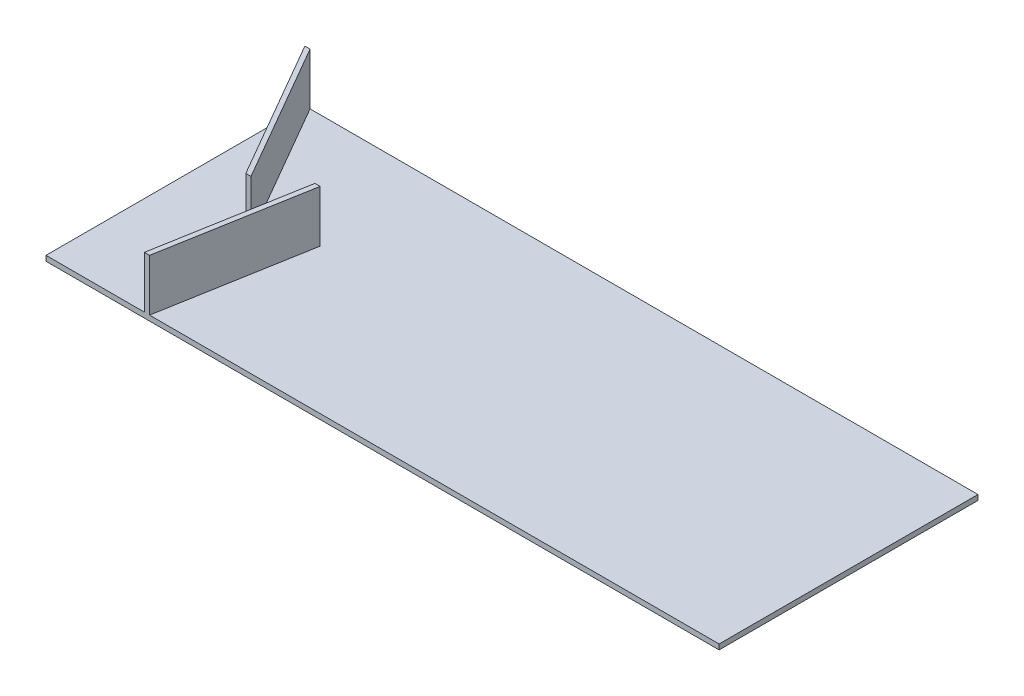
ISO-10303-21;
HEADER;
FILE_DESCRIPTION(('STEP AP214'),'2;1');
FILE_NAME('part.step','',(''),(''),'','','');
FILE_SCHEMA(('AUTOMOTIVE_DESIGN { 1 0 10303 214 1 1 1 1 }'));
ENDSEC;
DATA;
#1=APPLICATION_CONTEXT('core data for automotive mechanical design processes');
#2=APPLICATION_PROTOCOL_DEFINITION('international standard','automotive_design',2000,#1);
#3=PRODUCT_CONTEXT('',#1,'mechanical');
#4=PRODUCT('Part','Part','',(#3));
#5=PRODUCT_RELATED_PRODUCT_CATEGORY('part','',(#4));
#6=PRODUCT_DEFINITION_FORMATION('','',#4);
#7=PRODUCT_DEFINITION_CONTEXT('part definition',#1,'design');
#8=PRODUCT_DEFINITION('design','',#6,#7);
#9=PRODUCT_DEFINITION_SHAPE('','',#8);
#10=(LENGTH_UNIT() NAMED_UNIT(*) SI_UNIT(.MILLI.,.METRE.));
#11=(NAMED_UNIT(*) PLANE_ANGLE_UNIT() SI_UNIT($,.RADIAN.));
#12=(NAMED_UNIT(*) SI_UNIT($,.STERADIAN.) SOLID_ANGLE_UNIT());
#13=UNCERTAINTY_MEASURE_WITH_UNIT(LENGTH_MEASURE(1.E-05),#10,'distance_accuracy_value','');
#14=(GEOMETRIC_REPRESENTATION_CONTEXT(3) GLOBAL_UNCERTAINTY_ASSIGNED_CONTEXT((#13)) GLOBAL_UNIT_ASSIGNED_CONTEXT((#10,
#11,#12)) REPRESENTATION_CONTEXT('',''));
#15=CARTESIAN_POINT('',(0.,0.,0.));
#16=DIRECTION('',(0.,0.,1.));
#17=DIRECTION('',(1.,0.,0.));
#18=AXIS2_PLACEMENT_3D('',#15,#16,#17);
#19=CARTESIAN_POINT('',(0.,10.,0.));
#20=DIRECTION('',(0.,1.,0.));
#21=DIRECTION('',(0.,0.,1.));
#22=AXIS2_PLACEMENT_3D('',#19,#20,#21);
#23=PLANE('',#22);
#24=DIRECTION('',(1.,0.,0.));
#25=VECTOR('',#24,1.);
#26=CARTESIAN_POINT('',(155.884572681201,10.,20.));
#27=LINE('',#26,#25);
#28=CARTESIAN_POINT('',(155.884572681201,10.,20.));
#29=VERTEX_POINT('',#28);
#30=CARTESIAN_POINT('',(165.884572681201,10.,20.));
#31=VERTEX_POINT('',#30);
#32=EDGE_CURVE('E55',#29,#31,#27,.T.);
#33=ORIENTED_EDGE('',*,*,#32,.F.);
#34=DIRECTION('',(0.500000000000004,0.,0.866025403784436));
#35=VECTOR('',#34,1.);
#36=CARTESIAN_POINT('',(1.11022302462516E-13,10.,-250.));
#37=LINE('',#36,#35);
#38=CARTESIAN_POINT('',(1.11022302462516E-13,10.,-250.));
#39=VERTEX_POINT('',#38);
#40=EDGE_CURVE('E148',#39,#29,#37,.T.);
#41=ORIENTED_EDGE('',*,*,#40,.F.);
#42=DIRECTION('',(0.,0.,1.));
#43=VECTOR('',#42,1.);
#44=CARTESIAN_POINT('',(1.11022302462516E-13,10.,-250.));
#45=LINE('',#44,#43);
#46=CARTESIAN_POINT('',(1.11022302462516E-13,10.,250.));
#47=VERTEX_POINT('',#46);
#48=EDGE_CURVE('E198',#39,#47,#45,.T.);
#49=ORIENTED_EDGE('',*,*,#48,.T.);
#50=DIRECTION('',(1.,0.,0.));
#51=VECTOR('',#50,1.);
#52=CARTESIAN_POINT('',(1.11022302462516E-13,10.,250.));
#53=LINE('',#52,#51);
#54=CARTESIAN_POINT('',(190.,10.,250.));
#55=VERTEX_POINT('',#54);
#56=EDGE_CURVE('E204',#47,#55,#53,.T.);
#57=ORIENTED_EDGE('',*,*,#56,.T.);
#58=DIRECTION('',(-0.173648177666927,0.,0.984807753012209));
#59=VECTOR('',#58,1.);
#60=CARTESIAN_POINT('',(190.,10.,250.));
#61=LINE('',#60,#59);
#62=CARTESIAN_POINT('',(239.371554598369,10.,-30.));
#63=VERTEX_POINT('',#62);
#64=EDGE_CURVE('E166',#63,#55,#61,.T.);
#65=ORIENTED_EDGE('',*,*,#64,.F.);
#66=DIRECTION('',(-1.,0.,0.));
#67=VECTOR('',#66,1.);
#68=CARTESIAN_POINT('',(249.371554598369,10.,-30.));
#69=LINE('',#68,#67);
#70=CARTESIAN_POINT('',(249.371554598369,10.,-30.));
#71=VERTEX_POINT('',#70);
#72=EDGE_CURVE('E155',#71,#63,#69,.T.);
#73=ORIENTED_EDGE('',*,*,#72,.F.);
#74=DIRECTION('',(0.173648177666927,0.,-0.984807753012209));
#75=VECTOR('',#74,1.);
#76=CARTESIAN_POINT('',(200.,10.,250.));
#77=LINE('',#76,#75);
#78=CARTESIAN_POINT('',(200.,10.,250.));
#79=VERTEX_POINT('',#78);
#80=EDGE_CURVE('E150',#79,#71,#77,.T.);
#81=ORIENTED_EDGE('',*,*,#80,.F.);
#82=CARTESIAN_POINT('',(1300.,10.,250.));
#83=VERTEX_POINT('',#82);
#84=EDGE_CURVE('E202',#79,#83,#53,.T.);
#85=ORIENTED_EDGE('',*,*,#84,.T.);
#86=DIRECTION('',(0.,0.,-1.));
#87=VECTOR('',#86,1.);
#88=CARTESIAN_POINT('',(1300.,10.,-250.));
#89=LINE('',#88,#87);
#90=CARTESIAN_POINT('',(1300.,10.,-250.));
#91=VERTEX_POINT('',#90);
#92=EDGE_CURVE('E207',#83,#91,#89,.T.);
#93=ORIENTED_EDGE('',*,*,#92,.T.);
#94=DIRECTION('',(-1.,0.,0.));
#95=VECTOR('',#94,1.);
#96=CARTESIAN_POINT('',(1.11022302462516E-13,10.,-250.));
#97=LINE('',#96,#95);
#98=CARTESIAN_POINT('',(10.,10.,-250.));
#99=VERTEX_POINT('',#98);
#100=EDGE_CURVE('E210',#91,#99,#97,.T.);
#101=ORIENTED_EDGE('',*,*,#100,.T.);
#102=DIRECTION('',(-0.500000000000004,0.,-0.866025403784436));
#103=VECTOR('',#102,1.);
#104=CARTESIAN_POINT('',(10.,10.,-250.));
#105=LINE('',#104,#103);
#106=EDGE_CURVE('E60',#31,#99,#105,.T.);
#107=ORIENTED_EDGE('',*,*,#106,.F.);
#108=EDGE_LOOP('',(#33,#41,#49,#57,#65,#73,#81,#85,#93,#101,#107));
#109=FACE_BOUND('',#108,.T.);
#110=ADVANCED_FACE('F39',(#109),#23,.T.);
#111=CARTESIAN_POINT('',(1.11022302462516E-13,10.,-250.));
#112=DIRECTION('',(1.,0.,0.));
#113=DIRECTION('',(0.,0.,-1.));
#114=AXIS2_PLACEMENT_3D('',#111,#112,#113);
#115=PLANE('',#114);
#116=DIRECTION('',(0.,0.,1.));
#117=VECTOR('',#116,1.);
#118=CARTESIAN_POINT('',(1.11022302462516E-13,0.,-250.));
#119=LINE('',#118,#117);
#120=CARTESIAN_POINT('',(1.11022302462516E-13,0.,-250.));
#121=VERTEX_POINT('',#120);
#122=CARTESIAN_POINT('',(1.11022302462516E-13,0.,250.));
#123=VERTEX_POINT('',#122);
#124=EDGE_CURVE('E197',#121,#123,#119,.T.);
#125=ORIENTED_EDGE('',*,*,#124,.T.);
#126=DIRECTION('',(0.,-1.,0.));
#127=VECTOR('',#126,1.);
#128=CARTESIAN_POINT('',(1.11022302462516E-13,10.,250.));
#129=LINE('',#128,#127);
#130=EDGE_CURVE('E11',#47,#123,#129,.T.);
#131=ORIENTED_EDGE('',*,*,#130,.F.);
#132=ORIENTED_EDGE('',*,*,#48,.F.);
#133=DIRECTION('',(0.,-1.,0.));
#134=VECTOR('',#133,1.);
#135=CARTESIAN_POINT('',(1.11022302462516E-13,10.,-250.));
#136=LINE('',#135,#134);
#137=EDGE_CURVE('E213',#39,#121,#136,.T.);
#138=ORIENTED_EDGE('',*,*,#137,.T.);
#139=EDGE_LOOP('',(#125,#131,#132,#138));
#140=FACE_BOUND('',#139,.T.);
#141=ADVANCED_FACE('F41',(#140),#115,.F.);
#142=CARTESIAN_POINT('',(1.11022302462516E-13,10.,250.));
#143=DIRECTION('',(0.,0.,-1.));
#144=DIRECTION('',(-1.,0.,0.));
#145=AXIS2_PLACEMENT_3D('',#142,#143,#144);
#146=PLANE('',#145);
#147=DIRECTION('',(1.,0.,0.));
#148=VECTOR('',#147,1.);
#149=CARTESIAN_POINT('',(1.11022302462516E-13,0.,250.));
#150=LINE('',#149,#148);
#151=CARTESIAN_POINT('',(1300.,0.,250.));
#152=VERTEX_POINT('',#151);
#153=EDGE_CURVE('E217',#123,#152,#150,.T.);
#154=ORIENTED_EDGE('',*,*,#153,.T.);
#155=DIRECTION('',(0.,-1.,0.));
#156=VECTOR('',#155,1.);
#157=CARTESIAN_POINT('',(1300.,10.,250.));
#158=LINE('',#157,#156);
#159=EDGE_CURVE('E48',#83,#152,#158,.T.);
#160=ORIENTED_EDGE('',*,*,#159,.F.);
#161=ORIENTED_EDGE('',*,*,#84,.F.);
#162=DIRECTION('',(0.,-1.,0.));
#163=VECTOR('',#162,1.);
#164=CARTESIAN_POINT('',(200.,110.,250.));
#165=LINE('',#164,#163);
#166=CARTESIAN_POINT('',(200.,110.,250.));
#167=VERTEX_POINT('',#166);
#168=EDGE_CURVE('E174',#167,#79,#165,.T.);
#169=ORIENTED_EDGE('',*,*,#168,.F.);
#170=DIRECTION('',(1.,0.,0.));
#171=VECTOR('',#170,1.);
#172=CARTESIAN_POINT('',(200.,110.,250.));
#173=LINE('',#172,#171);
#174=CARTESIAN_POINT('',(190.,110.,250.));
#175=VERTEX_POINT('',#174);
#176=EDGE_CURVE('E172',#175,#167,#173,.T.);
#177=ORIENTED_EDGE('',*,*,#176,.F.);
#178=DIRECTION('',(0.,-1.,0.));
#179=VECTOR('',#178,1.);
#180=CARTESIAN_POINT('',(190.,110.,250.));
#181=LINE('',#180,#179);
#182=EDGE_CURVE('E185',#175,#55,#181,.T.);
#183=ORIENTED_EDGE('',*,*,#182,.T.);
#184=ORIENTED_EDGE('',*,*,#56,.F.);
#185=ORIENTED_EDGE('',*,*,#130,.T.);
#186=EDGE_LOOP('',(#154,#160,#161,#169,#177,#183,#184,#185));
#187=FACE_BOUND('',#186,.T.);
#188=ADVANCED_FACE('F271',(#187),#146,.F.);
#189=CARTESIAN_POINT('',(1300.,10.,-250.));
#190=DIRECTION('',(-1.,0.,0.));
#191=DIRECTION('',(0.,0.,1.));
#192=AXIS2_PLACEMENT_3D('',#189,#190,#191);
#193=PLANE('',#192);
#194=DIRECTION('',(0.,0.,-1.));
#195=VECTOR('',#194,1.);
#196=CARTESIAN_POINT('',(1300.,0.,-250.));
#197=LINE('',#196,#195);
#198=CARTESIAN_POINT('',(1300.,0.,-250.));
#199=VERTEX_POINT('',#198);
#200=EDGE_CURVE('E220',#152,#199,#197,.T.);
#201=ORIENTED_EDGE('',*,*,#200,.T.);
#202=DIRECTION('',(0.,-1.,0.));
#203=VECTOR('',#202,1.);
#204=CARTESIAN_POINT('',(1300.,10.,-250.));
#205=LINE('',#204,#203);
#206=EDGE_CURVE('E228',#91,#199,#205,.T.);
#207=ORIENTED_EDGE('',*,*,#206,.F.);
#208=ORIENTED_EDGE('',*,*,#92,.F.);
#209=ORIENTED_EDGE('',*,*,#159,.T.);
#210=EDGE_LOOP('',(#201,#207,#208,#209));
#211=FACE_BOUND('',#210,.T.);
#212=ADVANCED_FACE('F237',(#211),#193,.F.);
#213=CARTESIAN_POINT('',(1.11022302462516E-13,10.,-250.));
#214=DIRECTION('',(0.,0.,1.));
#215=DIRECTION('',(1.,0.,0.));
#216=AXIS2_PLACEMENT_3D('',#213,#214,#215);
#217=PLANE('',#216);
#218=DIRECTION('',(-1.,0.,0.));
#219=VECTOR('',#218,1.);
#220=CARTESIAN_POINT('',(1.11022302462516E-13,0.,-250.));
#221=LINE('',#220,#219);
#222=EDGE_CURVE('E203',#199,#121,#221,.T.);
#223=ORIENTED_EDGE('',*,*,#222,.T.);
#224=ORIENTED_EDGE('',*,*,#137,.F.);
#225=DIRECTION('',(0.,-1.,0.));
#226=VECTOR('',#225,1.);
#227=CARTESIAN_POINT('',(1.11022302462516E-13,110.,-250.));
#228=LINE('',#227,#226);
#229=CARTESIAN_POINT('',(1.11022302462516E-13,110.,-250.));
#230=VERTEX_POINT('',#229);
#231=EDGE_CURVE('E253',#230,#39,#228,.T.);
#232=ORIENTED_EDGE('',*,*,#231,.F.);
#233=DIRECTION('',(-1.,0.,0.));
#234=VECTOR('',#233,1.);
#235=CARTESIAN_POINT('',(1.11022302462516E-13,110.,-250.));
#236=LINE('',#235,#234);
#237=CARTESIAN_POINT('',(10.,110.,-250.));
#238=VERTEX_POINT('',#237);
#239=EDGE_CURVE('E141',#238,#230,#236,.T.);
#240=ORIENTED_EDGE('',*,*,#239,.F.);
#241=DIRECTION('',(0.,-1.,0.));
#242=VECTOR('',#241,1.);
#243=CARTESIAN_POINT('',(10.,110.,-250.));
#244=LINE('',#243,#242);
#245=EDGE_CURVE('E157',#238,#99,#244,.T.);
#246=ORIENTED_EDGE('',*,*,#245,.T.);
#247=ORIENTED_EDGE('',*,*,#100,.F.);
#248=ORIENTED_EDGE('',*,*,#206,.T.);
#249=EDGE_LOOP('',(#223,#224,#232,#240,#246,#247,#248));
#250=FACE_BOUND('',#249,.T.);
#251=ADVANCED_FACE('F247',(#250),#217,.F.);
#252=CARTESIAN_POINT('',(0.,0.,0.));
#253=DIRECTION('',(0.,1.,0.));
#254=DIRECTION('',(0.,0.,1.));
#255=AXIS2_PLACEMENT_3D('',#252,#253,#254);
#256=PLANE('',#255);
#257=ORIENTED_EDGE('',*,*,#124,.F.);
#258=ORIENTED_EDGE('',*,*,#222,.F.);
#259=ORIENTED_EDGE('',*,*,#200,.F.);
#260=ORIENTED_EDGE('',*,*,#153,.F.);
#261=EDGE_LOOP('',(#257,#258,#259,#260));
#262=FACE_BOUND('',#261,.T.);
#263=ADVANCED_FACE('F244',(#262),#256,.F.);
#264=CARTESIAN_POINT('',(200.,110.,250.));
#265=DIRECTION('',(-0.984807753012209,0.,-0.173648177666927));
#266=DIRECTION('',(-0.173648177666927,0.,0.984807753012209));
#267=AXIS2_PLACEMENT_3D('',#264,#265,#266);
#268=PLANE('',#267);
#269=ORIENTED_EDGE('',*,*,#80,.T.);
#270=DIRECTION('',(0.,-1.,0.));
#271=VECTOR('',#270,1.);
#272=CARTESIAN_POINT('',(249.371554598369,110.,-30.));
#273=LINE('',#272,#271);
#274=CARTESIAN_POINT('',(249.371554598369,110.,-30.));
#275=VERTEX_POINT('',#274);
#276=EDGE_CURVE('E193',#275,#71,#273,.T.);
#277=ORIENTED_EDGE('',*,*,#276,.F.);
#278=DIRECTION('',(0.173648177666927,0.,-0.984807753012209));
#279=VECTOR('',#278,1.);
#280=CARTESIAN_POINT('',(200.,110.,250.));
#281=LINE('',#280,#279);
#282=EDGE_CURVE('E161',#167,#275,#281,.T.);
#283=ORIENTED_EDGE('',*,*,#282,.F.);
#284=ORIENTED_EDGE('',*,*,#168,.T.);
#285=EDGE_LOOP('',(#269,#277,#283,#284));
#286=FACE_BOUND('',#285,.T.);
#287=ADVANCED_FACE('F275',(#286),#268,.F.);
#288=CARTESIAN_POINT('',(249.371554598369,110.,-30.));
#289=DIRECTION('',(0.,0.,1.));
#290=DIRECTION('',(1.,0.,0.));
#291=AXIS2_PLACEMENT_3D('',#288,#289,#290);
#292=PLANE('',#291);
#293=ORIENTED_EDGE('',*,*,#72,.T.);
#294=DIRECTION('',(0.,-1.,0.));
#295=VECTOR('',#294,1.);
#296=CARTESIAN_POINT('',(239.371554598369,110.,-30.));
#297=LINE('',#296,#295);
#298=CARTESIAN_POINT('',(239.371554598369,110.,-30.));
#299=VERTEX_POINT('',#298);
#300=EDGE_CURVE('E189',#299,#63,#297,.T.);
#301=ORIENTED_EDGE('',*,*,#300,.F.);
#302=DIRECTION('',(-1.,0.,0.));
#303=VECTOR('',#302,1.);
#304=CARTESIAN_POINT('',(249.371554598369,110.,-30.));
#305=LINE('',#304,#303);
#306=EDGE_CURVE('E165',#275,#299,#305,.T.);
#307=ORIENTED_EDGE('',*,*,#306,.F.);
#308=ORIENTED_EDGE('',*,*,#276,.T.);
#309=EDGE_LOOP('',(#293,#301,#307,#308));
#310=FACE_BOUND('',#309,.T.);
#311=ADVANCED_FACE('F285',(#310),#292,.F.);
#312=CARTESIAN_POINT('',(190.,110.,250.));
#313=DIRECTION('',(0.984807753012209,0.,0.173648177666927));
#314=DIRECTION('',(0.173648177666927,0.,-0.984807753012209));
#315=AXIS2_PLACEMENT_3D('',#312,#313,#314);
#316=PLANE('',#315);
#317=ORIENTED_EDGE('',*,*,#64,.T.);
#318=ORIENTED_EDGE('',*,*,#182,.F.);
#319=DIRECTION('',(-0.173648177666927,0.,0.984807753012209));
#320=VECTOR('',#319,1.);
#321=CARTESIAN_POINT('',(190.,110.,250.));
#322=LINE('',#321,#320);
#323=EDGE_CURVE('E169',#299,#175,#322,.T.);
#324=ORIENTED_EDGE('',*,*,#323,.F.);
#325=ORIENTED_EDGE('',*,*,#300,.T.);
#326=EDGE_LOOP('',(#317,#318,#324,#325));
#327=FACE_BOUND('',#326,.T.);
#328=ADVANCED_FACE('F283',(#327),#316,.F.);
#329=CARTESIAN_POINT('',(0.,110.,0.));
#330=DIRECTION('',(0.,1.,0.));
#331=DIRECTION('',(0.,0.,1.));
#332=AXIS2_PLACEMENT_3D('',#329,#330,#331);
#333=PLANE('',#332);
#334=ORIENTED_EDGE('',*,*,#282,.T.);
#335=ORIENTED_EDGE('',*,*,#306,.T.);
#336=ORIENTED_EDGE('',*,*,#323,.T.);
#337=ORIENTED_EDGE('',*,*,#176,.T.);
#338=EDGE_LOOP('',(#334,#335,#336,#337));
#339=FACE_BOUND('',#338,.T.);
#340=ADVANCED_FACE('F278',(#339),#333,.T.);
#341=CARTESIAN_POINT('',(1.11022302462516E-13,110.,-250.));
#342=DIRECTION('',(0.866025403784436,0.,-0.500000000000004));
#343=DIRECTION('',(-0.500000000000004,0.,-0.866025403784436));
#344=AXIS2_PLACEMENT_3D('',#341,#342,#343);
#345=PLANE('',#344);
#346=ORIENTED_EDGE('',*,*,#40,.T.);
#347=DIRECTION('',(0.,-1.,0.));
#348=VECTOR('',#347,1.);
#349=CARTESIAN_POINT('',(155.884572681201,110.,20.));
#350=LINE('',#349,#348);
#351=CARTESIAN_POINT('',(155.884572681201,110.,20.));
#352=VERTEX_POINT('',#351);
#353=EDGE_CURVE('E128',#352,#29,#350,.T.);
#354=ORIENTED_EDGE('',*,*,#353,.F.);
#355=DIRECTION('',(0.500000000000004,0.,0.866025403784436));
#356=VECTOR('',#355,1.);
#357=CARTESIAN_POINT('',(1.11022302462516E-13,110.,-250.));
#358=LINE('',#357,#356);
#359=EDGE_CURVE('E136',#230,#352,#358,.T.);
#360=ORIENTED_EDGE('',*,*,#359,.F.);
#361=ORIENTED_EDGE('',*,*,#231,.T.);
#362=EDGE_LOOP('',(#346,#354,#360,#361));
#363=FACE_BOUND('',#362,.T.);
#364=ADVANCED_FACE('F147',(#363),#345,.F.);
#365=CARTESIAN_POINT('',(155.884572681201,110.,20.));
#366=DIRECTION('',(0.,0.,-1.));
#367=DIRECTION('',(-1.,0.,0.));
#368=AXIS2_PLACEMENT_3D('',#365,#366,#367);
#369=PLANE('',#368);
#370=ORIENTED_EDGE('',*,*,#32,.T.);
#371=DIRECTION('',(0.,-1.,0.));
#372=VECTOR('',#371,1.);
#373=CARTESIAN_POINT('',(165.884572681201,110.,20.));
#374=LINE('',#373,#372);
#375=CARTESIAN_POINT('',(165.884572681201,110.,20.));
#376=VERTEX_POINT('',#375);
#377=EDGE_CURVE('E131',#376,#31,#374,.T.);
#378=ORIENTED_EDGE('',*,*,#377,.F.);
#379=DIRECTION('',(1.,0.,0.));
#380=VECTOR('',#379,1.);
#381=CARTESIAN_POINT('',(155.884572681201,110.,20.));
#382=LINE('',#381,#380);
#383=EDGE_CURVE('E124',#352,#376,#382,.T.);
#384=ORIENTED_EDGE('',*,*,#383,.F.);
#385=ORIENTED_EDGE('',*,*,#353,.T.);
#386=EDGE_LOOP('',(#370,#378,#384,#385));
#387=FACE_BOUND('',#386,.T.);
#388=ADVANCED_FACE('F126',(#387),#369,.F.);
#389=CARTESIAN_POINT('',(10.,110.,-250.));
#390=DIRECTION('',(-0.866025403784436,0.,0.500000000000004));
#391=DIRECTION('',(0.500000000000005,0.,0.866025403784436));
#392=AXIS2_PLACEMENT_3D('',#389,#390,#391);
#393=PLANE('',#392);
#394=ORIENTED_EDGE('',*,*,#106,.T.);
#395=ORIENTED_EDGE('',*,*,#245,.F.);
#396=DIRECTION('',(-0.500000000000004,0.,-0.866025403784436));
#397=VECTOR('',#396,1.);
#398=CARTESIAN_POINT('',(10.,110.,-250.));
#399=LINE('',#398,#397);
#400=EDGE_CURVE('E135',#376,#238,#399,.T.);
#401=ORIENTED_EDGE('',*,*,#400,.F.);
#402=ORIENTED_EDGE('',*,*,#377,.T.);
#403=EDGE_LOOP('',(#394,#395,#401,#402));
#404=FACE_BOUND('',#403,.T.);
#405=ADVANCED_FACE('F268',(#404),#393,.F.);
#406=CARTESIAN_POINT('',(0.,110.,0.));
#407=DIRECTION('',(0.,1.,0.));
#408=DIRECTION('',(0.,0.,1.));
#409=AXIS2_PLACEMENT_3D('',#406,#407,#408);
#410=PLANE('',#409);
#411=ORIENTED_EDGE('',*,*,#359,.T.);
#412=ORIENTED_EDGE('',*,*,#383,.T.);
#413=ORIENTED_EDGE('',*,*,#400,.T.);
#414=ORIENTED_EDGE('',*,*,#239,.T.);
#415=EDGE_LOOP('',(#411,#412,#413,#414));
#416=FACE_BOUND('',#415,.T.);
#417=ADVANCED_FACE('F139',(#416),#410,.T.);
#418=CLOSED_SHELL('',(#110,#141,#188,#212,#251,#263,#287,#311,#328,#340,#364,#388,#405,#417));
#419=MANIFOLD_SOLID_BREP('B2',#418);
#420=ADVANCED_BREP_SHAPE_REPRESENTATION('',(#18,#419),#14);
#421=SHAPE_DEFINITION_REPRESENTATION(#9,#420);
ENDSEC;
END-ISO-10303-21;
